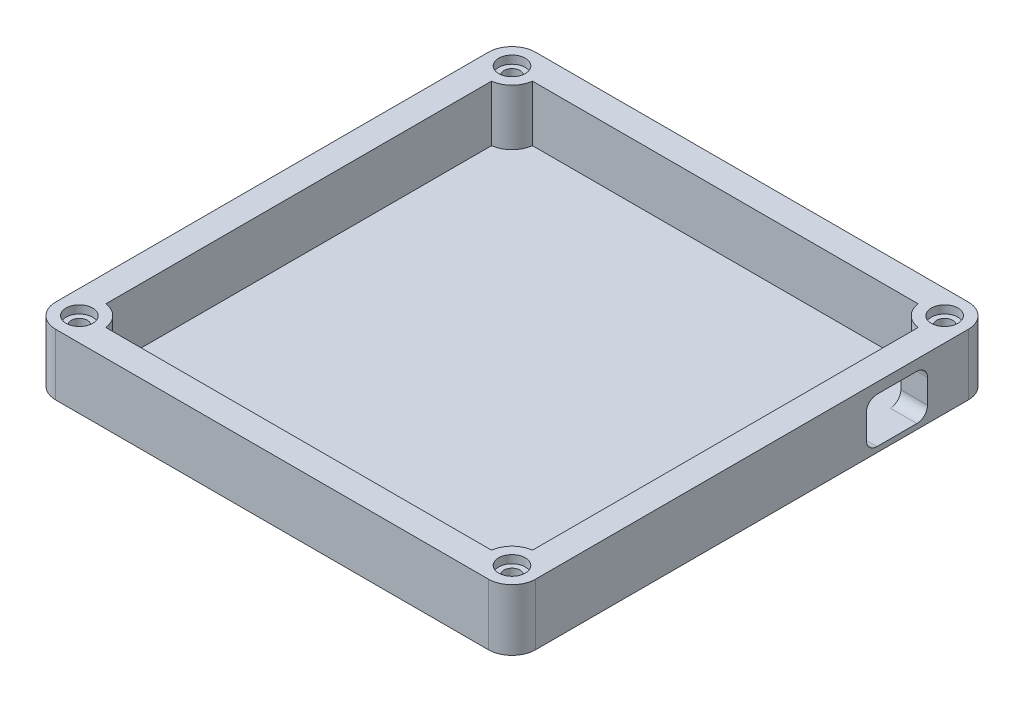
ISO-10303-21;
HEADER;
FILE_DESCRIPTION(('STEP AP214'),'2;1');
FILE_NAME('part.step','',(''),(''),'','','');
FILE_SCHEMA(('AUTOMOTIVE_DESIGN { 1 0 10303 214 1 1 1 1 }'));
ENDSEC;
DATA;
#1=APPLICATION_CONTEXT('core data for automotive mechanical design processes');
#2=APPLICATION_PROTOCOL_DEFINITION('international standard','automotive_design',2000,#1);
#3=PRODUCT_CONTEXT('',#1,'mechanical');
#4=PRODUCT('Part','Part','',(#3));
#5=PRODUCT_RELATED_PRODUCT_CATEGORY('part','',(#4));
#6=PRODUCT_DEFINITION_FORMATION('','',#4);
#7=PRODUCT_DEFINITION_CONTEXT('part definition',#1,'design');
#8=PRODUCT_DEFINITION('design','',#6,#7);
#9=PRODUCT_DEFINITION_SHAPE('','',#8);
#10=(LENGTH_UNIT() NAMED_UNIT(*) SI_UNIT(.MILLI.,.METRE.));
#11=(NAMED_UNIT(*) PLANE_ANGLE_UNIT() SI_UNIT($,.RADIAN.));
#12=(NAMED_UNIT(*) SI_UNIT($,.STERADIAN.) SOLID_ANGLE_UNIT());
#13=UNCERTAINTY_MEASURE_WITH_UNIT(LENGTH_MEASURE(1.E-05),#10,'distance_accuracy_value','');
#14=(GEOMETRIC_REPRESENTATION_CONTEXT(3) GLOBAL_UNCERTAINTY_ASSIGNED_CONTEXT((#13)) GLOBAL_UNIT_ASSIGNED_CONTEXT((#10,
#11,#12)) REPRESENTATION_CONTEXT('',''));
#15=CARTESIAN_POINT('',(0.,0.,0.));
#16=DIRECTION('',(0.,0.,1.));
#17=DIRECTION('',(1.,0.,0.));
#18=AXIS2_PLACEMENT_3D('',#15,#16,#17);
#19=CARTESIAN_POINT('',(45.0808846481362,11.5,0.));
#20=DIRECTION('',(1.,0.,0.));
#21=DIRECTION('',(0.,0.,-1.));
#22=AXIS2_PLACEMENT_3D('',#19,#20,#21);
#23=PLANE('',#22);
#24=DIRECTION('',(0.,0.,1.));
#25=VECTOR('',#24,1.);
#26=CARTESIAN_POINT('',(45.0808846481362,0.,0.));
#27=LINE('',#26,#25);
#28=CARTESIAN_POINT('',(45.0808846481362,0.,-40.64));
#29=VERTEX_POINT('',#28);
#30=CARTESIAN_POINT('',(45.0808846481362,0.,40.64));
#31=VERTEX_POINT('',#30);
#32=EDGE_CURVE('E407',#29,#31,#27,.T.);
#33=ORIENTED_EDGE('',*,*,#32,.F.);
#34=DIRECTION('',(0.,-1.,0.));
#35=VECTOR('',#34,1.);
#36=CARTESIAN_POINT('',(45.0808846481362,11.5,-40.64));
#37=LINE('',#36,#35);
#38=CARTESIAN_POINT('',(45.0808846481362,11.5,-40.64));
#39=VERTEX_POINT('',#38);
#40=EDGE_CURVE('E446',#39,#29,#37,.T.);
#41=ORIENTED_EDGE('',*,*,#40,.F.);
#42=DIRECTION('',(0.,0.,1.));
#43=VECTOR('',#42,1.);
#44=CARTESIAN_POINT('',(45.0808846481362,11.5,0.));
#45=LINE('',#44,#43);
#46=CARTESIAN_POINT('',(45.0808846481362,11.5,40.64));
#47=VERTEX_POINT('',#46);
#48=EDGE_CURVE('E378',#39,#47,#45,.T.);
#49=ORIENTED_EDGE('',*,*,#48,.T.);
#50=DIRECTION('',(0.,-1.,0.));
#51=VECTOR('',#50,1.);
#52=CARTESIAN_POINT('',(45.0808846481362,11.5,40.64));
#53=LINE('',#52,#51);
#54=EDGE_CURVE('E449',#47,#31,#53,.T.);
#55=ORIENTED_EDGE('',*,*,#54,.T.);
#56=EDGE_LOOP('',(#33,#41,#49,#55));
#57=FACE_BOUND('',#56,.T.);
#58=DIRECTION('',(0.,-1.,0.));
#59=VECTOR('',#58,1.);
#60=CARTESIAN_POINT('',(45.0808846481362,0.,-32.979));
#61=LINE('',#60,#59);
#62=CARTESIAN_POINT('',(45.0808846481362,7.5,-32.979));
#63=VERTEX_POINT('',#62);
#64=CARTESIAN_POINT('',(45.0808846481362,3.,-32.979));
#65=VERTEX_POINT('',#64);
#66=EDGE_CURVE('E283',#63,#65,#61,.T.);
#67=ORIENTED_EDGE('',*,*,#66,.T.);
#68=CARTESIAN_POINT('',(45.0808846481362,3.,-30.979));
#69=DIRECTION('',(1.,0.,0.));
#70=DIRECTION('',(0.,0.,-1.));
#71=AXIS2_PLACEMENT_3D('',#68,#69,#70);
#72=CIRCLE('',#71,2.);
#73=CARTESIAN_POINT('',(45.0808846481362,0.999999999999999,-30.979));
#74=VERTEX_POINT('',#73);
#75=EDGE_CURVE('E280',#65,#74,#72,.F.);
#76=ORIENTED_EDGE('',*,*,#75,.T.);
#77=DIRECTION('',(0.,0.,1.));
#78=VECTOR('',#77,1.);
#79=CARTESIAN_POINT('',(45.0808846481362,0.999999999999999,0.));
#80=LINE('',#79,#78);
#81=CARTESIAN_POINT('',(45.0808846481362,0.999999999999999,-23.479));
#82=VERTEX_POINT('',#81);
#83=EDGE_CURVE('E216',#74,#82,#80,.T.);
#84=ORIENTED_EDGE('',*,*,#83,.T.);
#85=CARTESIAN_POINT('',(45.0808846481362,3.,-23.479));
#86=DIRECTION('',(1.,0.,0.));
#87=DIRECTION('',(0.,0.,-1.));
#88=AXIS2_PLACEMENT_3D('',#85,#86,#87);
#89=CIRCLE('',#88,2.);
#90=CARTESIAN_POINT('',(45.0808846481362,3.,-21.479));
#91=VERTEX_POINT('',#90);
#92=EDGE_CURVE('E303',#82,#91,#89,.F.);
#93=ORIENTED_EDGE('',*,*,#92,.T.);
#94=DIRECTION('',(0.,1.,0.));
#95=VECTOR('',#94,1.);
#96=CARTESIAN_POINT('',(45.0808846481362,0.,-21.479));
#97=LINE('',#96,#95);
#98=CARTESIAN_POINT('',(45.0808846481362,7.5,-21.479));
#99=VERTEX_POINT('',#98);
#100=EDGE_CURVE('E299',#91,#99,#97,.T.);
#101=ORIENTED_EDGE('',*,*,#100,.T.);
#102=CARTESIAN_POINT('',(45.0808846481362,7.5,-23.479));
#103=DIRECTION('',(1.,0.,0.));
#104=DIRECTION('',(0.,0.,-1.));
#105=AXIS2_PLACEMENT_3D('',#102,#103,#104);
#106=CIRCLE('',#105,2.);
#107=CARTESIAN_POINT('',(45.0808846481362,9.5,-23.479));
#108=VERTEX_POINT('',#107);
#109=EDGE_CURVE('E295',#108,#99,#106,.T.);
#110=ORIENTED_EDGE('',*,*,#109,.F.);
#111=DIRECTION('',(0.,0.,-1.));
#112=VECTOR('',#111,1.);
#113=CARTESIAN_POINT('',(45.0808846481362,9.5,0.));
#114=LINE('',#113,#112);
#115=CARTESIAN_POINT('',(45.0808846481362,9.5,-30.979));
#116=VERTEX_POINT('',#115);
#117=EDGE_CURVE('E291',#108,#116,#114,.T.);
#118=ORIENTED_EDGE('',*,*,#117,.T.);
#119=CARTESIAN_POINT('',(45.0808846481362,7.5,-30.979));
#120=DIRECTION('',(1.,0.,0.));
#121=DIRECTION('',(0.,0.,-1.));
#122=AXIS2_PLACEMENT_3D('',#119,#120,#121);
#123=CIRCLE('',#122,2.);
#124=EDGE_CURVE('E287',#63,#116,#123,.T.);
#125=ORIENTED_EDGE('',*,*,#124,.F.);
#126=EDGE_LOOP('',(#67,#76,#84,#93,#101,#110,#118,#125));
#127=FACE_BOUND('',#126,.T.);
#128=ADVANCED_FACE('F43',(#57,#127),#23,.T.);
#129=CARTESIAN_POINT('',(40.0808846481362,11.5,0.));
#130=DIRECTION('',(-1.,0.,0.));
#131=DIRECTION('',(0.,0.,1.));
#132=AXIS2_PLACEMENT_3D('',#129,#130,#131);
#133=PLANE('',#132);
#134=DIRECTION('',(0.,0.,-1.));
#135=VECTOR('',#134,1.);
#136=CARTESIAN_POINT('',(40.0808846481362,1.,0.));
#137=LINE('',#136,#135);
#138=CARTESIAN_POINT('',(40.0808846481362,0.999999999999999,36.2344527602848));
#139=VERTEX_POINT('',#138);
#140=CARTESIAN_POINT('',(40.0808846481362,0.999999999999999,-23.479));
#141=VERTEX_POINT('',#140);
#142=EDGE_CURVE('E61',#139,#141,#137,.T.);
#143=ORIENTED_EDGE('',*,*,#142,.F.);
#144=DIRECTION('',(0.,-1.,0.));
#145=VECTOR('',#144,1.);
#146=CARTESIAN_POINT('',(40.0808846481362,11.5,36.2344527602848));
#147=LINE('',#146,#145);
#148=CARTESIAN_POINT('',(40.0808846481362,11.5,36.2344527602848));
#149=VERTEX_POINT('',#148);
#150=EDGE_CURVE('E399',#149,#139,#147,.T.);
#151=ORIENTED_EDGE('',*,*,#150,.F.);
#152=DIRECTION('',(0.,0.,-1.));
#153=VECTOR('',#152,1.);
#154=CARTESIAN_POINT('',(40.0808846481362,11.5,0.));
#155=LINE('',#154,#153);
#156=CARTESIAN_POINT('',(40.0808846481362,11.5,-36.2344527602848));
#157=VERTEX_POINT('',#156);
#158=EDGE_CURVE('E368',#149,#157,#155,.T.);
#159=ORIENTED_EDGE('',*,*,#158,.T.);
#160=DIRECTION('',(0.,-1.,0.));
#161=VECTOR('',#160,1.);
#162=CARTESIAN_POINT('',(40.0808846481362,11.5,-36.2344527602848));
#163=LINE('',#162,#161);
#164=CARTESIAN_POINT('',(40.0808846481362,0.999999999999999,-36.2344527602848));
#165=VERTEX_POINT('',#164);
#166=EDGE_CURVE('E232',#157,#165,#163,.T.);
#167=ORIENTED_EDGE('',*,*,#166,.T.);
#168=CARTESIAN_POINT('',(40.0808846481362,1.,-30.979));
#169=VERTEX_POINT('',#168);
#170=EDGE_CURVE('E214',#169,#165,#137,.T.);
#171=ORIENTED_EDGE('',*,*,#170,.F.);
#172=CARTESIAN_POINT('',(40.0808846481362,3.,-30.979));
#173=DIRECTION('',(-1.,0.,0.));
#174=DIRECTION('',(0.,0.,1.));
#175=AXIS2_PLACEMENT_3D('',#172,#173,#174);
#176=CIRCLE('',#175,2.);
#177=CARTESIAN_POINT('',(40.0808846481362,3.,-32.979));
#178=VERTEX_POINT('',#177);
#179=EDGE_CURVE('E11',#169,#178,#176,.F.);
#180=ORIENTED_EDGE('',*,*,#179,.T.);
#181=DIRECTION('',(0.,1.,0.));
#182=VECTOR('',#181,1.);
#183=CARTESIAN_POINT('',(40.0808846481362,11.5,-32.979));
#184=LINE('',#183,#182);
#185=CARTESIAN_POINT('',(40.0808846481362,7.5,-32.979));
#186=VERTEX_POINT('',#185);
#187=EDGE_CURVE('E455',#178,#186,#184,.T.);
#188=ORIENTED_EDGE('',*,*,#187,.T.);
#189=CARTESIAN_POINT('',(40.0808846481362,7.5,-30.979));
#190=DIRECTION('',(-1.,0.,0.));
#191=DIRECTION('',(0.,0.,1.));
#192=AXIS2_PLACEMENT_3D('',#189,#190,#191);
#193=CIRCLE('',#192,2.);
#194=CARTESIAN_POINT('',(40.0808846481362,9.5,-30.979));
#195=VERTEX_POINT('',#194);
#196=EDGE_CURVE('E484',#195,#186,#193,.T.);
#197=ORIENTED_EDGE('',*,*,#196,.F.);
#198=DIRECTION('',(0.,0.,1.));
#199=VECTOR('',#198,1.);
#200=CARTESIAN_POINT('',(40.0808846481362,9.5,0.));
#201=LINE('',#200,#199);
#202=CARTESIAN_POINT('',(40.0808846481362,9.5,-23.479));
#203=VERTEX_POINT('',#202);
#204=EDGE_CURVE('E488',#195,#203,#201,.T.);
#205=ORIENTED_EDGE('',*,*,#204,.T.);
#206=CARTESIAN_POINT('',(40.0808846481362,7.5,-23.479));
#207=DIRECTION('',(-1.,0.,0.));
#208=DIRECTION('',(0.,0.,1.));
#209=AXIS2_PLACEMENT_3D('',#206,#207,#208);
#210=CIRCLE('',#209,2.);
#211=CARTESIAN_POINT('',(40.0808846481362,7.5,-21.479));
#212=VERTEX_POINT('',#211);
#213=EDGE_CURVE('E492',#212,#203,#210,.T.);
#214=ORIENTED_EDGE('',*,*,#213,.F.);
#215=DIRECTION('',(0.,-1.,0.));
#216=VECTOR('',#215,1.);
#217=CARTESIAN_POINT('',(40.0808846481362,11.5,-21.479));
#218=LINE('',#217,#216);
#219=CARTESIAN_POINT('',(40.0808846481362,3.,-21.479));
#220=VERTEX_POINT('',#219);
#221=EDGE_CURVE('E495',#212,#220,#218,.T.);
#222=ORIENTED_EDGE('',*,*,#221,.T.);
#223=CARTESIAN_POINT('',(40.0808846481362,3.,-23.479));
#224=DIRECTION('',(-1.,0.,0.));
#225=DIRECTION('',(0.,0.,1.));
#226=AXIS2_PLACEMENT_3D('',#223,#224,#225);
#227=CIRCLE('',#226,2.);
#228=EDGE_CURVE('E53',#220,#141,#227,.F.);
#229=ORIENTED_EDGE('',*,*,#228,.T.);
#230=EDGE_LOOP('',(#143,#151,#159,#167,#171,#180,#188,#197,#205,#214,#222,#229));
#231=FACE_BOUND('',#230,.T.);
#232=ADVANCED_FACE('F229',(#231),#133,.T.);
#233=CARTESIAN_POINT('',(0.,11.5,45.0808846481362));
#234=DIRECTION('',(0.,0.,-1.));
#235=DIRECTION('',(-1.,0.,0.));
#236=AXIS2_PLACEMENT_3D('',#233,#234,#235);
#237=PLANE('',#236);
#238=DIRECTION('',(1.,0.,0.));
#239=VECTOR('',#238,1.);
#240=CARTESIAN_POINT('',(0.,0.,45.0808846481362));
#241=LINE('',#240,#239);
#242=CARTESIAN_POINT('',(-40.64,0.,45.0808846481362));
#243=VERTEX_POINT('',#242);
#244=CARTESIAN_POINT('',(40.64,0.,45.0808846481362));
#245=VERTEX_POINT('',#244);
#246=EDGE_CURVE('E343',#243,#245,#241,.T.);
#247=ORIENTED_EDGE('',*,*,#246,.T.);
#248=DIRECTION('',(0.,-1.,0.));
#249=VECTOR('',#248,1.);
#250=CARTESIAN_POINT('',(40.64,11.5,45.0808846481362));
#251=LINE('',#250,#249);
#252=CARTESIAN_POINT('',(40.64,11.5,45.0808846481362));
#253=VERTEX_POINT('',#252);
#254=EDGE_CURVE('E452',#253,#245,#251,.T.);
#255=ORIENTED_EDGE('',*,*,#254,.F.);
#256=DIRECTION('',(1.,0.,0.));
#257=VECTOR('',#256,1.);
#258=CARTESIAN_POINT('',(0.,11.5,45.0808846481362));
#259=LINE('',#258,#257);
#260=CARTESIAN_POINT('',(-40.64,11.5,45.0808846481362));
#261=VERTEX_POINT('',#260);
#262=EDGE_CURVE('E371',#261,#253,#259,.T.);
#263=ORIENTED_EDGE('',*,*,#262,.F.);
#264=DIRECTION('',(0.,-1.,0.));
#265=VECTOR('',#264,1.);
#266=CARTESIAN_POINT('',(-40.64,11.5,45.0808846481362));
#267=LINE('',#266,#265);
#268=EDGE_CURVE('E429',#261,#243,#267,.T.);
#269=ORIENTED_EDGE('',*,*,#268,.T.);
#270=EDGE_LOOP('',(#247,#255,#263,#269));
#271=FACE_BOUND('',#270,.T.);
#272=ADVANCED_FACE('F539',(#271),#237,.F.);
#273=CARTESIAN_POINT('',(40.64,11.5,40.64));
#274=DIRECTION('',(0.,-1.,0.));
#275=DIRECTION('',(0.,0.,-1.));
#276=AXIS2_PLACEMENT_3D('',#273,#274,#275);
#277=CYLINDRICAL_SURFACE('',#276,4.44088464813619);
#278=CARTESIAN_POINT('',(40.64,0.,40.64));
#279=DIRECTION('',(0.,1.,0.));
#280=DIRECTION('',(0.,0.,1.));
#281=AXIS2_PLACEMENT_3D('',#278,#279,#280);
#282=CIRCLE('',#281,4.44088464813619);
#283=EDGE_CURVE('E403',#31,#245,#282,.F.);
#284=ORIENTED_EDGE('',*,*,#283,.F.);
#285=ORIENTED_EDGE('',*,*,#54,.F.);
#286=CARTESIAN_POINT('',(40.64,11.5,40.64));
#287=DIRECTION('',(0.,1.,0.));
#288=DIRECTION('',(0.,0.,1.));
#289=AXIS2_PLACEMENT_3D('',#286,#287,#288);
#290=CIRCLE('',#289,4.44088464813619);
#291=EDGE_CURVE('E374',#47,#253,#290,.F.);
#292=ORIENTED_EDGE('',*,*,#291,.T.);
#293=ORIENTED_EDGE('',*,*,#254,.T.);
#294=EDGE_LOOP('',(#284,#285,#292,#293));
#295=FACE_BOUND('',#294,.T.);
#296=ADVANCED_FACE('F547',(#295),#277,.T.);
#297=CARTESIAN_POINT('',(40.64,11.5,-40.64));
#298=DIRECTION('',(0.,-1.,0.));
#299=DIRECTION('',(0.,0.,-1.));
#300=AXIS2_PLACEMENT_3D('',#297,#298,#299);
#301=CYLINDRICAL_SURFACE('',#300,4.44088464813619);
#302=CARTESIAN_POINT('',(40.64,0.,-40.64));
#303=DIRECTION('',(0.,1.,0.));
#304=DIRECTION('',(0.,0.,1.));
#305=AXIS2_PLACEMENT_3D('',#302,#303,#304);
#306=CIRCLE('',#305,4.44088464813619);
#307=CARTESIAN_POINT('',(40.64,0.,-45.0808846481362));
#308=VERTEX_POINT('',#307);
#309=EDGE_CURVE('E411',#29,#308,#306,.T.);
#310=ORIENTED_EDGE('',*,*,#309,.T.);
#311=DIRECTION('',(0.,-1.,0.));
#312=VECTOR('',#311,1.);
#313=CARTESIAN_POINT('',(40.64,11.5,-45.0808846481362));
#314=LINE('',#313,#312);
#315=CARTESIAN_POINT('',(40.64,11.5,-45.0808846481362));
#316=VERTEX_POINT('',#315);
#317=EDGE_CURVE('E443',#316,#308,#314,.T.);
#318=ORIENTED_EDGE('',*,*,#317,.F.);
#319=CARTESIAN_POINT('',(40.64,11.5,-40.64));
#320=DIRECTION('',(0.,1.,0.));
#321=DIRECTION('',(0.,0.,1.));
#322=AXIS2_PLACEMENT_3D('',#319,#320,#321);
#323=CIRCLE('',#322,4.44088464813619);
#324=EDGE_CURVE('E382',#39,#316,#323,.T.);
#325=ORIENTED_EDGE('',*,*,#324,.F.);
#326=ORIENTED_EDGE('',*,*,#40,.T.);
#327=EDGE_LOOP('',(#310,#318,#325,#326));
#328=FACE_BOUND('',#327,.T.);
#329=ADVANCED_FACE('F545',(#328),#301,.T.);
#330=CARTESIAN_POINT('',(0.,11.5,-45.0808846481362));
#331=DIRECTION('',(0.,0.,-1.));
#332=DIRECTION('',(-1.,0.,0.));
#333=AXIS2_PLACEMENT_3D('',#330,#331,#332);
#334=PLANE('',#333);
#335=DIRECTION('',(1.,0.,0.));
#336=VECTOR('',#335,1.);
#337=CARTESIAN_POINT('',(0.,0.,-45.0808846481362));
#338=LINE('',#337,#336);
#339=CARTESIAN_POINT('',(-40.64,0.,-45.0808846481362));
#340=VERTEX_POINT('',#339);
#341=EDGE_CURVE('E415',#340,#308,#338,.T.);
#342=ORIENTED_EDGE('',*,*,#341,.F.);
#343=DIRECTION('',(0.,-1.,0.));
#344=VECTOR('',#343,1.);
#345=CARTESIAN_POINT('',(-40.64,11.5,-45.0808846481362));
#346=LINE('',#345,#344);
#347=CARTESIAN_POINT('',(-40.64,11.5,-45.0808846481362));
#348=VERTEX_POINT('',#347);
#349=EDGE_CURVE('E440',#348,#340,#346,.T.);
#350=ORIENTED_EDGE('',*,*,#349,.F.);
#351=DIRECTION('',(1.,0.,0.));
#352=VECTOR('',#351,1.);
#353=CARTESIAN_POINT('',(0.,11.5,-45.0808846481362));
#354=LINE('',#353,#352);
#355=EDGE_CURVE('E385',#348,#316,#354,.T.);
#356=ORIENTED_EDGE('',*,*,#355,.T.);
#357=ORIENTED_EDGE('',*,*,#317,.T.);
#358=EDGE_LOOP('',(#342,#350,#356,#357));
#359=FACE_BOUND('',#358,.T.);
#360=ADVANCED_FACE('F629',(#359),#334,.T.);
#361=CARTESIAN_POINT('',(-40.64,11.5,-40.64));
#362=DIRECTION('',(0.,-1.,0.));
#363=DIRECTION('',(0.,0.,-1.));
#364=AXIS2_PLACEMENT_3D('',#361,#362,#363);
#365=CYLINDRICAL_SURFACE('',#364,4.44088464813619);
#366=CARTESIAN_POINT('',(-40.64,0.,-40.64));
#367=DIRECTION('',(0.,1.,0.));
#368=DIRECTION('',(0.,0.,1.));
#369=AXIS2_PLACEMENT_3D('',#366,#367,#368);
#370=CIRCLE('',#369,4.44088464813619);
#371=CARTESIAN_POINT('',(-45.0808846481362,0.,-40.64));
#372=VERTEX_POINT('',#371);
#373=EDGE_CURVE('E419',#340,#372,#370,.T.);
#374=ORIENTED_EDGE('',*,*,#373,.T.);
#375=DIRECTION('',(0.,-1.,0.));
#376=VECTOR('',#375,1.);
#377=CARTESIAN_POINT('',(-45.0808846481362,11.5,-40.64));
#378=LINE('',#377,#376);
#379=CARTESIAN_POINT('',(-45.0808846481362,11.5,-40.64));
#380=VERTEX_POINT('',#379);
#381=EDGE_CURVE('E437',#380,#372,#378,.T.);
#382=ORIENTED_EDGE('',*,*,#381,.F.);
#383=CARTESIAN_POINT('',(-40.64,11.5,-40.64));
#384=DIRECTION('',(0.,1.,0.));
#385=DIRECTION('',(0.,0.,1.));
#386=AXIS2_PLACEMENT_3D('',#383,#384,#385);
#387=CIRCLE('',#386,4.44088464813619);
#388=EDGE_CURVE('E389',#348,#380,#387,.T.);
#389=ORIENTED_EDGE('',*,*,#388,.F.);
#390=ORIENTED_EDGE('',*,*,#349,.T.);
#391=EDGE_LOOP('',(#374,#382,#389,#390));
#392=FACE_BOUND('',#391,.T.);
#393=ADVANCED_FACE('F634',(#392),#365,.T.);
#394=CARTESIAN_POINT('',(-45.0808846481362,11.5,0.));
#395=DIRECTION('',(-1.,0.,0.));
#396=DIRECTION('',(0.,0.,1.));
#397=AXIS2_PLACEMENT_3D('',#394,#395,#396);
#398=PLANE('',#397);
#399=DIRECTION('',(0.,0.,-1.));
#400=VECTOR('',#399,1.);
#401=CARTESIAN_POINT('',(-45.0808846481362,0.,0.));
#402=LINE('',#401,#400);
#403=CARTESIAN_POINT('',(-45.0808846481362,0.,40.64));
#404=VERTEX_POINT('',#403);
#405=EDGE_CURVE('E423',#404,#372,#402,.T.);
#406=ORIENTED_EDGE('',*,*,#405,.F.);
#407=DIRECTION('',(0.,-1.,0.));
#408=VECTOR('',#407,1.);
#409=CARTESIAN_POINT('',(-45.0808846481362,11.5,40.64));
#410=LINE('',#409,#408);
#411=CARTESIAN_POINT('',(-45.0808846481362,11.5,40.64));
#412=VERTEX_POINT('',#411);
#413=EDGE_CURVE('E433',#412,#404,#410,.T.);
#414=ORIENTED_EDGE('',*,*,#413,.F.);
#415=DIRECTION('',(0.,0.,-1.));
#416=VECTOR('',#415,1.);
#417=CARTESIAN_POINT('',(-45.0808846481362,11.5,0.));
#418=LINE('',#417,#416);
#419=EDGE_CURVE('E392',#412,#380,#418,.T.);
#420=ORIENTED_EDGE('',*,*,#419,.T.);
#421=ORIENTED_EDGE('',*,*,#381,.T.);
#422=EDGE_LOOP('',(#406,#414,#420,#421));
#423=FACE_BOUND('',#422,.T.);
#424=ADVANCED_FACE('F580',(#423),#398,.T.);
#425=CARTESIAN_POINT('',(40.64,11.5,40.64));
#426=DIRECTION('',(0.,-1.,0.));
#427=DIRECTION('',(0.,0.,-1.));
#428=AXIS2_PLACEMENT_3D('',#425,#426,#427);
#429=CYLINDRICAL_SURFACE('',#428,4.44088464813619);
#430=ORIENTED_EDGE('',*,*,#150,.T.);
#431=CARTESIAN_POINT('',(40.64,1.,40.64));
#432=DIRECTION('',(0.,1.,0.));
#433=DIRECTION('',(0.,0.,1.));
#434=AXIS2_PLACEMENT_3D('',#431,#432,#433);
#435=CIRCLE('',#434,4.44088464813619);
#436=CARTESIAN_POINT('',(36.2344527602848,0.999999999999999,40.0808846481362));
#437=VERTEX_POINT('',#436);
#438=EDGE_CURVE('E68',#437,#139,#435,.F.);
#439=ORIENTED_EDGE('',*,*,#438,.F.);
#440=DIRECTION('',(0.,-1.,0.));
#441=VECTOR('',#440,1.);
#442=CARTESIAN_POINT('',(36.2344527602848,11.5,40.0808846481362));
#443=LINE('',#442,#441);
#444=CARTESIAN_POINT('',(36.2344527602848,11.5,40.0808846481362));
#445=VERTEX_POINT('',#444);
#446=EDGE_CURVE('E434',#445,#437,#443,.T.);
#447=ORIENTED_EDGE('',*,*,#446,.F.);
#448=CARTESIAN_POINT('',(40.64,11.5,40.64));
#449=DIRECTION('',(0.,1.,0.));
#450=DIRECTION('',(0.,0.,1.));
#451=AXIS2_PLACEMENT_3D('',#448,#449,#450);
#452=CIRCLE('',#451,4.44088464813619);
#453=EDGE_CURVE('E344',#149,#445,#452,.T.);
#454=ORIENTED_EDGE('',*,*,#453,.F.);
#455=EDGE_LOOP('',(#430,#439,#447,#454));
#456=FACE_BOUND('',#455,.T.);
#457=ADVANCED_FACE('F45',(#456),#429,.T.);
#458=CARTESIAN_POINT('',(0.,11.5,40.0808846481362));
#459=DIRECTION('',(0.,0.,1.));
#460=DIRECTION('',(1.,0.,0.));
#461=AXIS2_PLACEMENT_3D('',#458,#459,#460);
#462=PLANE('',#461);
#463=ORIENTED_EDGE('',*,*,#446,.T.);
#464=DIRECTION('',(1.,0.,0.));
#465=VECTOR('',#464,1.);
#466=CARTESIAN_POINT('',(0.,1.,40.0808846481362));
#467=LINE('',#466,#465);
#468=CARTESIAN_POINT('',(-36.2344527602848,0.999999999999999,40.0808846481362));
#469=VERTEX_POINT('',#468);
#470=EDGE_CURVE('E238',#469,#437,#467,.T.);
#471=ORIENTED_EDGE('',*,*,#470,.F.);
#472=DIRECTION('',(0.,-1.,0.));
#473=VECTOR('',#472,1.);
#474=CARTESIAN_POINT('',(-36.2344527602848,11.5,40.0808846481362));
#475=LINE('',#474,#473);
#476=CARTESIAN_POINT('',(-36.2344527602848,11.5,40.0808846481362));
#477=VERTEX_POINT('',#476);
#478=EDGE_CURVE('E476',#477,#469,#475,.T.);
#479=ORIENTED_EDGE('',*,*,#478,.F.);
#480=DIRECTION('',(-1.,0.,0.));
#481=VECTOR('',#480,1.);
#482=CARTESIAN_POINT('',(0.,11.5,40.0808846481362));
#483=LINE('',#482,#481);
#484=EDGE_CURVE('E348',#445,#477,#483,.T.);
#485=ORIENTED_EDGE('',*,*,#484,.F.);
#486=EDGE_LOOP('',(#463,#471,#479,#485));
#487=FACE_BOUND('',#486,.T.);
#488=ADVANCED_FACE('F573',(#487),#462,.F.);
#489=CARTESIAN_POINT('',(-40.64,11.5,40.64));
#490=DIRECTION('',(0.,-1.,0.));
#491=DIRECTION('',(0.,0.,-1.));
#492=AXIS2_PLACEMENT_3D('',#489,#490,#491);
#493=CYLINDRICAL_SURFACE('',#492,4.44088464813619);
#494=ORIENTED_EDGE('',*,*,#478,.T.);
#495=CARTESIAN_POINT('',(-40.64,1.,40.64));
#496=DIRECTION('',(0.,1.,0.));
#497=DIRECTION('',(0.,0.,1.));
#498=AXIS2_PLACEMENT_3D('',#495,#496,#497);
#499=CIRCLE('',#498,4.44088464813619);
#500=CARTESIAN_POINT('',(-40.0808846481362,0.999999999999999,36.2344527602848));
#501=VERTEX_POINT('',#500);
#502=EDGE_CURVE('E271',#501,#469,#499,.F.);
#503=ORIENTED_EDGE('',*,*,#502,.F.);
#504=DIRECTION('',(0.,-1.,0.));
#505=VECTOR('',#504,1.);
#506=CARTESIAN_POINT('',(-40.0808846481362,11.5,36.2344527602848));
#507=LINE('',#506,#505);
#508=CARTESIAN_POINT('',(-40.0808846481362,11.5,36.2344527602848));
#509=VERTEX_POINT('',#508);
#510=EDGE_CURVE('E472',#509,#501,#507,.T.);
#511=ORIENTED_EDGE('',*,*,#510,.F.);
#512=CARTESIAN_POINT('',(-40.64,11.5,40.64));
#513=DIRECTION('',(0.,1.,0.));
#514=DIRECTION('',(0.,0.,1.));
#515=AXIS2_PLACEMENT_3D('',#512,#513,#514);
#516=CIRCLE('',#515,4.44088464813619);
#517=EDGE_CURVE('E352',#477,#509,#516,.T.);
#518=ORIENTED_EDGE('',*,*,#517,.F.);
#519=EDGE_LOOP('',(#494,#503,#511,#518));
#520=FACE_BOUND('',#519,.T.);
#521=ADVANCED_FACE('F570',(#520),#493,.T.);
#522=CARTESIAN_POINT('',(-40.0808846481362,11.5,0.));
#523=DIRECTION('',(-1.,0.,0.));
#524=DIRECTION('',(0.,0.,1.));
#525=AXIS2_PLACEMENT_3D('',#522,#523,#524);
#526=PLANE('',#525);
#527=ORIENTED_EDGE('',*,*,#510,.T.);
#528=DIRECTION('',(0.,0.,1.));
#529=VECTOR('',#528,1.);
#530=CARTESIAN_POINT('',(-40.0808846481362,1.,0.));
#531=LINE('',#530,#529);
#532=CARTESIAN_POINT('',(-40.0808846481362,0.999999999999999,-36.2344527602848));
#533=VERTEX_POINT('',#532);
#534=EDGE_CURVE('E586',#533,#501,#531,.T.);
#535=ORIENTED_EDGE('',*,*,#534,.F.);
#536=DIRECTION('',(0.,-1.,0.));
#537=VECTOR('',#536,1.);
#538=CARTESIAN_POINT('',(-40.0808846481362,11.5,-36.2344527602848));
#539=LINE('',#538,#537);
#540=CARTESIAN_POINT('',(-40.0808846481362,11.5,-36.2344527602848));
#541=VERTEX_POINT('',#540);
#542=EDGE_CURVE('E468',#541,#533,#539,.T.);
#543=ORIENTED_EDGE('',*,*,#542,.F.);
#544=DIRECTION('',(0.,0.,-1.));
#545=VECTOR('',#544,1.);
#546=CARTESIAN_POINT('',(-40.0808846481362,11.5,0.));
#547=LINE('',#546,#545);
#548=EDGE_CURVE('E355',#509,#541,#547,.T.);
#549=ORIENTED_EDGE('',*,*,#548,.F.);
#550=EDGE_LOOP('',(#527,#535,#543,#549));
#551=FACE_BOUND('',#550,.T.);
#552=ADVANCED_FACE('F566',(#551),#526,.F.);
#553=CARTESIAN_POINT('',(-40.64,11.5,-40.64));
#554=DIRECTION('',(0.,-1.,0.));
#555=DIRECTION('',(0.,0.,-1.));
#556=AXIS2_PLACEMENT_3D('',#553,#554,#555);
#557=CYLINDRICAL_SURFACE('',#556,4.44088464813619);
#558=ORIENTED_EDGE('',*,*,#542,.T.);
#559=CARTESIAN_POINT('',(-40.64,1.,-40.64));
#560=DIRECTION('',(0.,1.,0.));
#561=DIRECTION('',(0.,0.,1.));
#562=AXIS2_PLACEMENT_3D('',#559,#560,#561);
#563=CIRCLE('',#562,4.44088464813619);
#564=CARTESIAN_POINT('',(-36.2344527602848,0.999999999999999,-40.0808846481362));
#565=VERTEX_POINT('',#564);
#566=EDGE_CURVE('E591',#565,#533,#563,.F.);
#567=ORIENTED_EDGE('',*,*,#566,.F.);
#568=DIRECTION('',(0.,-1.,0.));
#569=VECTOR('',#568,1.);
#570=CARTESIAN_POINT('',(-36.2344527602848,11.5,-40.0808846481362));
#571=LINE('',#570,#569);
#572=CARTESIAN_POINT('',(-36.2344527602848,11.5,-40.0808846481362));
#573=VERTEX_POINT('',#572);
#574=EDGE_CURVE('E464',#573,#565,#571,.T.);
#575=ORIENTED_EDGE('',*,*,#574,.F.);
#576=CARTESIAN_POINT('',(-40.64,11.5,-40.64));
#577=DIRECTION('',(0.,1.,0.));
#578=DIRECTION('',(0.,0.,1.));
#579=AXIS2_PLACEMENT_3D('',#576,#577,#578);
#580=CIRCLE('',#579,4.44088464813619);
#581=EDGE_CURVE('E358',#541,#573,#580,.T.);
#582=ORIENTED_EDGE('',*,*,#581,.F.);
#583=EDGE_LOOP('',(#558,#567,#575,#582));
#584=FACE_BOUND('',#583,.T.);
#585=ADVANCED_FACE('F562',(#584),#557,.T.);
#586=CARTESIAN_POINT('',(0.,11.5,-40.0808846481362));
#587=DIRECTION('',(0.,0.,1.));
#588=DIRECTION('',(1.,0.,0.));
#589=AXIS2_PLACEMENT_3D('',#586,#587,#588);
#590=PLANE('',#589);
#591=DIRECTION('',(-1.,0.,0.));
#592=VECTOR('',#591,1.);
#593=CARTESIAN_POINT('',(0.,1.,-40.0808846481362));
#594=LINE('',#593,#592);
#595=CARTESIAN_POINT('',(36.2344527602848,0.999999999999999,-40.0808846481362));
#596=VERTEX_POINT('',#595);
#597=EDGE_CURVE('E595',#596,#565,#594,.T.);
#598=ORIENTED_EDGE('',*,*,#597,.F.);
#599=DIRECTION('',(0.,-1.,0.));
#600=VECTOR('',#599,1.);
#601=CARTESIAN_POINT('',(36.2344527602848,11.5,-40.0808846481362));
#602=LINE('',#601,#600);
#603=CARTESIAN_POINT('',(36.2344527602848,11.5,-40.0808846481362));
#604=VERTEX_POINT('',#603);
#605=EDGE_CURVE('E460',#604,#596,#602,.T.);
#606=ORIENTED_EDGE('',*,*,#605,.F.);
#607=DIRECTION('',(-1.,0.,0.));
#608=VECTOR('',#607,1.);
#609=CARTESIAN_POINT('',(0.,11.5,-40.0808846481362));
#610=LINE('',#609,#608);
#611=EDGE_CURVE('E361',#604,#573,#610,.T.);
#612=ORIENTED_EDGE('',*,*,#611,.T.);
#613=ORIENTED_EDGE('',*,*,#574,.T.);
#614=EDGE_LOOP('',(#598,#606,#612,#613));
#615=FACE_BOUND('',#614,.T.);
#616=ADVANCED_FACE('F558',(#615),#590,.T.);
#617=CARTESIAN_POINT('',(40.64,11.5,-40.64));
#618=DIRECTION('',(0.,-1.,0.));
#619=DIRECTION('',(0.,0.,-1.));
#620=AXIS2_PLACEMENT_3D('',#617,#618,#619);
#621=CYLINDRICAL_SURFACE('',#620,4.44088464813619);
#622=ORIENTED_EDGE('',*,*,#605,.T.);
#623=CARTESIAN_POINT('',(40.64,1.,-40.64));
#624=DIRECTION('',(0.,1.,0.));
#625=DIRECTION('',(0.,0.,1.));
#626=AXIS2_PLACEMENT_3D('',#623,#624,#625);
#627=CIRCLE('',#626,4.44088464813619);
#628=EDGE_CURVE('E237',#165,#596,#627,.F.);
#629=ORIENTED_EDGE('',*,*,#628,.F.);
#630=ORIENTED_EDGE('',*,*,#166,.F.);
#631=CARTESIAN_POINT('',(40.64,11.5,-40.64));
#632=DIRECTION('',(0.,1.,0.));
#633=DIRECTION('',(0.,0.,1.));
#634=AXIS2_PLACEMENT_3D('',#631,#632,#633);
#635=CIRCLE('',#634,4.44088464813619);
#636=EDGE_CURVE('E365',#604,#157,#635,.T.);
#637=ORIENTED_EDGE('',*,*,#636,.F.);
#638=EDGE_LOOP('',(#622,#629,#630,#637));
#639=FACE_BOUND('',#638,.T.);
#640=ADVANCED_FACE('F554',(#639),#621,.T.);
#641=CARTESIAN_POINT('',(-40.64,11.5,40.64));
#642=DIRECTION('',(0.,-1.,0.));
#643=DIRECTION('',(0.,0.,-1.));
#644=AXIS2_PLACEMENT_3D('',#641,#642,#643);
#645=CYLINDRICAL_SURFACE('',#644,4.44088464813619);
#646=CARTESIAN_POINT('',(-40.64,0.,40.64));
#647=DIRECTION('',(0.,1.,0.));
#648=DIRECTION('',(0.,0.,1.));
#649=AXIS2_PLACEMENT_3D('',#646,#647,#648);
#650=CIRCLE('',#649,4.44088464813619);
#651=EDGE_CURVE('E349',#404,#243,#650,.T.);
#652=ORIENTED_EDGE('',*,*,#651,.T.);
#653=ORIENTED_EDGE('',*,*,#268,.F.);
#654=CARTESIAN_POINT('',(-40.64,11.5,40.64));
#655=DIRECTION('',(0.,1.,0.));
#656=DIRECTION('',(0.,0.,1.));
#657=AXIS2_PLACEMENT_3D('',#654,#655,#656);
#658=CIRCLE('',#657,4.44088464813619);
#659=EDGE_CURVE('E396',#412,#261,#658,.T.);
#660=ORIENTED_EDGE('',*,*,#659,.F.);
#661=ORIENTED_EDGE('',*,*,#413,.T.);
#662=EDGE_LOOP('',(#652,#653,#660,#661));
#663=FACE_BOUND('',#662,.T.);
#664=ADVANCED_FACE('F557',(#663),#645,.T.);
#665=CARTESIAN_POINT('',(0.,11.5,0.));
#666=DIRECTION('',(0.,1.,0.));
#667=DIRECTION('',(0.,0.,1.));
#668=AXIS2_PLACEMENT_3D('',#665,#666,#667);
#669=PLANE('',#668);
#670=CARTESIAN_POINT('',(-40.64,11.5,40.64));
#671=DIRECTION('',(0.,1.,0.));
#672=DIRECTION('',(0.,0.,1.));
#673=AXIS2_PLACEMENT_3D('',#670,#671,#672);
#674=CIRCLE('',#673,2.5);
#675=CARTESIAN_POINT('',(-40.64,11.5,43.14));
#676=VERTEX_POINT('',#675);
#677=EDGE_CURVE('E267',#676,#676,#674,.T.);
#678=ORIENTED_EDGE('',*,*,#677,.F.);
#679=EDGE_LOOP('',(#678));
#680=FACE_BOUND('',#679,.T.);
#681=CARTESIAN_POINT('',(40.64,11.5,40.64));
#682=DIRECTION('',(0.,1.,0.));
#683=DIRECTION('',(0.,0.,1.));
#684=AXIS2_PLACEMENT_3D('',#681,#682,#683);
#685=CIRCLE('',#684,2.5);
#686=CARTESIAN_POINT('',(40.64,11.5,43.14));
#687=VERTEX_POINT('',#686);
#688=EDGE_CURVE('E259',#687,#687,#685,.T.);
#689=ORIENTED_EDGE('',*,*,#688,.F.);
#690=EDGE_LOOP('',(#689));
#691=FACE_BOUND('',#690,.T.);
#692=CARTESIAN_POINT('',(40.64,11.5,-40.64));
#693=DIRECTION('',(0.,1.,0.));
#694=DIRECTION('',(0.,0.,1.));
#695=AXIS2_PLACEMENT_3D('',#692,#693,#694);
#696=CIRCLE('',#695,2.5);
#697=CARTESIAN_POINT('',(40.64,11.5,-38.14));
#698=VERTEX_POINT('',#697);
#699=EDGE_CURVE('E251',#698,#698,#696,.T.);
#700=ORIENTED_EDGE('',*,*,#699,.F.);
#701=EDGE_LOOP('',(#700));
#702=FACE_BOUND('',#701,.T.);
#703=CARTESIAN_POINT('',(-40.64,11.5,-40.64));
#704=DIRECTION('',(0.,1.,0.));
#705=DIRECTION('',(0.,0.,1.));
#706=AXIS2_PLACEMENT_3D('',#703,#704,#705);
#707=CIRCLE('',#706,2.5);
#708=CARTESIAN_POINT('',(-40.64,11.5,-38.14));
#709=VERTEX_POINT('',#708);
#710=EDGE_CURVE('E250',#709,#709,#707,.T.);
#711=ORIENTED_EDGE('',*,*,#710,.F.);
#712=EDGE_LOOP('',(#711));
#713=FACE_BOUND('',#712,.T.);
#714=ORIENTED_EDGE('',*,*,#453,.T.);
#715=ORIENTED_EDGE('',*,*,#484,.T.);
#716=ORIENTED_EDGE('',*,*,#517,.T.);
#717=ORIENTED_EDGE('',*,*,#548,.T.);
#718=ORIENTED_EDGE('',*,*,#581,.T.);
#719=ORIENTED_EDGE('',*,*,#611,.F.);
#720=ORIENTED_EDGE('',*,*,#636,.T.);
#721=ORIENTED_EDGE('',*,*,#158,.F.);
#722=EDGE_LOOP('',(#714,#715,#716,#717,#718,#719,#720,#721));
#723=FACE_BOUND('',#722,.T.);
#724=ORIENTED_EDGE('',*,*,#262,.T.);
#725=ORIENTED_EDGE('',*,*,#291,.F.);
#726=ORIENTED_EDGE('',*,*,#48,.F.);
#727=ORIENTED_EDGE('',*,*,#324,.T.);
#728=ORIENTED_EDGE('',*,*,#355,.F.);
#729=ORIENTED_EDGE('',*,*,#388,.T.);
#730=ORIENTED_EDGE('',*,*,#419,.F.);
#731=ORIENTED_EDGE('',*,*,#659,.T.);
#732=EDGE_LOOP('',(#724,#725,#726,#727,#728,#729,#730,#731));
#733=FACE_BOUND('',#732,.T.);
#734=ADVANCED_FACE('F607',(#680,#691,#702,#713,#723,#733),#669,.T.);
#735=CARTESIAN_POINT('',(0.,0.,0.));
#736=DIRECTION('',(0.,1.,0.));
#737=DIRECTION('',(0.,0.,1.));
#738=AXIS2_PLACEMENT_3D('',#735,#736,#737);
#739=PLANE('',#738);
#740=ORIENTED_EDGE('',*,*,#246,.F.);
#741=ORIENTED_EDGE('',*,*,#651,.F.);
#742=ORIENTED_EDGE('',*,*,#405,.T.);
#743=ORIENTED_EDGE('',*,*,#373,.F.);
#744=ORIENTED_EDGE('',*,*,#341,.T.);
#745=ORIENTED_EDGE('',*,*,#309,.F.);
#746=ORIENTED_EDGE('',*,*,#32,.T.);
#747=ORIENTED_EDGE('',*,*,#283,.T.);
#748=EDGE_LOOP('',(#740,#741,#742,#743,#744,#745,#746,#747));
#749=FACE_BOUND('',#748,.T.);
#750=ADVANCED_FACE('F611',(#749),#739,.F.);
#751=CARTESIAN_POINT('',(37.0808846481362,3.,-30.979));
#752=DIRECTION('',(1.,0.,0.));
#753=DIRECTION('',(0.,0.,-1.));
#754=AXIS2_PLACEMENT_3D('',#751,#752,#753);
#755=CYLINDRICAL_SURFACE('',#754,2.);
#756=DIRECTION('',(1.,0.,0.));
#757=VECTOR('',#756,1.);
#758=CARTESIAN_POINT('',(37.0808846481362,0.999999999999999,-30.979));
#759=LINE('',#758,#757);
#760=EDGE_CURVE('E209',#169,#74,#759,.T.);
#761=ORIENTED_EDGE('',*,*,#760,.T.);
#762=ORIENTED_EDGE('',*,*,#75,.F.);
#763=DIRECTION('',(1.,0.,0.));
#764=VECTOR('',#763,1.);
#765=CARTESIAN_POINT('',(37.0808846481362,3.,-32.979));
#766=LINE('',#765,#764);
#767=EDGE_CURVE('E226',#178,#65,#766,.T.);
#768=ORIENTED_EDGE('',*,*,#767,.F.);
#769=ORIENTED_EDGE('',*,*,#179,.F.);
#770=EDGE_LOOP('',(#761,#762,#768,#769));
#771=FACE_BOUND('',#770,.T.);
#772=ADVANCED_FACE('F224',(#771),#755,.F.);
#773=CARTESIAN_POINT('',(37.0808846481362,0.999999999999999,0.));
#774=DIRECTION('',(0.,1.,0.));
#775=DIRECTION('',(0.,0.,1.));
#776=AXIS2_PLACEMENT_3D('',#773,#774,#775);
#777=PLANE('',#776);
#778=DIRECTION('',(1.,0.,0.));
#779=VECTOR('',#778,1.);
#780=CARTESIAN_POINT('',(37.0808846481362,0.999999999999999,-23.479));
#781=LINE('',#780,#779);
#782=EDGE_CURVE('E221',#141,#82,#781,.T.);
#783=ORIENTED_EDGE('',*,*,#782,.T.);
#784=ORIENTED_EDGE('',*,*,#83,.F.);
#785=ORIENTED_EDGE('',*,*,#760,.F.);
#786=ORIENTED_EDGE('',*,*,#170,.T.);
#787=ORIENTED_EDGE('',*,*,#628,.T.);
#788=ORIENTED_EDGE('',*,*,#597,.T.);
#789=ORIENTED_EDGE('',*,*,#566,.T.);
#790=ORIENTED_EDGE('',*,*,#534,.T.);
#791=ORIENTED_EDGE('',*,*,#502,.T.);
#792=ORIENTED_EDGE('',*,*,#470,.T.);
#793=ORIENTED_EDGE('',*,*,#438,.T.);
#794=ORIENTED_EDGE('',*,*,#142,.T.);
#795=EDGE_LOOP('',(#783,#784,#785,#786,#787,#788,#789,#790,#791,#792,#793,#794));
#796=FACE_BOUND('',#795,.T.);
#797=ADVANCED_FACE('F211',(#796),#777,.T.);
#798=CARTESIAN_POINT('',(37.0808846481362,3.,-23.479));
#799=DIRECTION('',(1.,0.,0.));
#800=DIRECTION('',(0.,0.,-1.));
#801=AXIS2_PLACEMENT_3D('',#798,#799,#800);
#802=CYLINDRICAL_SURFACE('',#801,2.);
#803=DIRECTION('',(1.,0.,0.));
#804=VECTOR('',#803,1.);
#805=CARTESIAN_POINT('',(37.0808846481362,3.,-21.479));
#806=LINE('',#805,#804);
#807=EDGE_CURVE('E311',#220,#91,#806,.T.);
#808=ORIENTED_EDGE('',*,*,#807,.T.);
#809=ORIENTED_EDGE('',*,*,#92,.F.);
#810=ORIENTED_EDGE('',*,*,#782,.F.);
#811=ORIENTED_EDGE('',*,*,#228,.F.);
#812=EDGE_LOOP('',(#808,#809,#810,#811));
#813=FACE_BOUND('',#812,.T.);
#814=ADVANCED_FACE('F742',(#813),#802,.F.);
#815=CARTESIAN_POINT('',(37.0808846481362,0.,-21.479));
#816=DIRECTION('',(0.,0.,-1.));
#817=DIRECTION('',(-1.,0.,0.));
#818=AXIS2_PLACEMENT_3D('',#815,#816,#817);
#819=PLANE('',#818);
#820=DIRECTION('',(1.,0.,0.));
#821=VECTOR('',#820,1.);
#822=CARTESIAN_POINT('',(37.0808846481362,7.5,-21.479));
#823=LINE('',#822,#821);
#824=EDGE_CURVE('E314',#212,#99,#823,.T.);
#825=ORIENTED_EDGE('',*,*,#824,.T.);
#826=ORIENTED_EDGE('',*,*,#100,.F.);
#827=ORIENTED_EDGE('',*,*,#807,.F.);
#828=ORIENTED_EDGE('',*,*,#221,.F.);
#829=EDGE_LOOP('',(#825,#826,#827,#828));
#830=FACE_BOUND('',#829,.T.);
#831=ADVANCED_FACE('F747',(#830),#819,.T.);
#832=CARTESIAN_POINT('',(37.0808846481362,7.5,-23.479));
#833=DIRECTION('',(1.,0.,0.));
#834=DIRECTION('',(0.,0.,-1.));
#835=AXIS2_PLACEMENT_3D('',#832,#833,#834);
#836=CYLINDRICAL_SURFACE('',#835,2.);
#837=ORIENTED_EDGE('',*,*,#213,.T.);
#838=DIRECTION('',(1.,0.,0.));
#839=VECTOR('',#838,1.);
#840=CARTESIAN_POINT('',(37.0808846481362,9.5,-23.479));
#841=LINE('',#840,#839);
#842=EDGE_CURVE('E317',#203,#108,#841,.T.);
#843=ORIENTED_EDGE('',*,*,#842,.T.);
#844=ORIENTED_EDGE('',*,*,#109,.T.);
#845=ORIENTED_EDGE('',*,*,#824,.F.);
#846=EDGE_LOOP('',(#837,#843,#844,#845));
#847=FACE_BOUND('',#846,.T.);
#848=ADVANCED_FACE('F758',(#847),#836,.F.);
#849=CARTESIAN_POINT('',(37.0808846481362,9.5,0.));
#850=DIRECTION('',(0.,-1.,0.));
#851=DIRECTION('',(0.,0.,-1.));
#852=AXIS2_PLACEMENT_3D('',#849,#850,#851);
#853=PLANE('',#852);
#854=DIRECTION('',(1.,0.,0.));
#855=VECTOR('',#854,1.);
#856=CARTESIAN_POINT('',(37.0808846481362,9.5,-30.979));
#857=LINE('',#856,#855);
#858=EDGE_CURVE('E320',#195,#116,#857,.T.);
#859=ORIENTED_EDGE('',*,*,#858,.T.);
#860=ORIENTED_EDGE('',*,*,#117,.F.);
#861=ORIENTED_EDGE('',*,*,#842,.F.);
#862=ORIENTED_EDGE('',*,*,#204,.F.);
#863=EDGE_LOOP('',(#859,#860,#861,#862));
#864=FACE_BOUND('',#863,.T.);
#865=ADVANCED_FACE('F765',(#864),#853,.T.);
#866=CARTESIAN_POINT('',(37.0808846481362,7.5,-30.979));
#867=DIRECTION('',(1.,0.,0.));
#868=DIRECTION('',(0.,0.,-1.));
#869=AXIS2_PLACEMENT_3D('',#866,#867,#868);
#870=CYLINDRICAL_SURFACE('',#869,2.);
#871=ORIENTED_EDGE('',*,*,#196,.T.);
#872=DIRECTION('',(1.,0.,0.));
#873=VECTOR('',#872,1.);
#874=CARTESIAN_POINT('',(37.0808846481362,7.5,-32.979));
#875=LINE('',#874,#873);
#876=EDGE_CURVE('E323',#186,#63,#875,.T.);
#877=ORIENTED_EDGE('',*,*,#876,.T.);
#878=ORIENTED_EDGE('',*,*,#124,.T.);
#879=ORIENTED_EDGE('',*,*,#858,.F.);
#880=EDGE_LOOP('',(#871,#877,#878,#879));
#881=FACE_BOUND('',#880,.T.);
#882=ADVANCED_FACE('F773',(#881),#870,.F.);
#883=CARTESIAN_POINT('',(37.0808846481362,0.,-32.979));
#884=DIRECTION('',(0.,0.,1.));
#885=DIRECTION('',(1.,0.,0.));
#886=AXIS2_PLACEMENT_3D('',#883,#884,#885);
#887=PLANE('',#886);
#888=ORIENTED_EDGE('',*,*,#767,.T.);
#889=ORIENTED_EDGE('',*,*,#66,.F.);
#890=ORIENTED_EDGE('',*,*,#876,.F.);
#891=ORIENTED_EDGE('',*,*,#187,.F.);
#892=EDGE_LOOP('',(#888,#889,#890,#891));
#893=FACE_BOUND('',#892,.T.);
#894=ADVANCED_FACE('F781',(#893),#887,.T.);
#895=CARTESIAN_POINT('',(-40.64,10.,40.64));
#896=DIRECTION('',(0.,1.,0.));
#897=DIRECTION('',(0.,0.,1.));
#898=AXIS2_PLACEMENT_3D('',#895,#896,#897);
#899=PLANE('',#898);
#900=CARTESIAN_POINT('',(-40.64,10.,40.64));
#901=DIRECTION('',(0.,1.,0.));
#902=DIRECTION('',(0.,0.,1.));
#903=AXIS2_PLACEMENT_3D('',#900,#901,#902);
#904=CIRCLE('',#903,2.5);
#905=CARTESIAN_POINT('',(-40.64,10.,43.14));
#906=VERTEX_POINT('',#905);
#907=EDGE_CURVE('E263',#906,#906,#904,.T.);
#908=ORIENTED_EDGE('',*,*,#907,.T.);
#909=EDGE_LOOP('',(#908));
#910=FACE_BOUND('',#909,.T.);
#911=CARTESIAN_POINT('',(-40.64,10.,40.64));
#912=DIRECTION('',(0.,1.,0.));
#913=DIRECTION('',(0.,0.,1.));
#914=AXIS2_PLACEMENT_3D('',#911,#912,#913);
#915=CIRCLE('',#914,1.5);
#916=CARTESIAN_POINT('',(-40.64,10.,42.14));
#917=VERTEX_POINT('',#916);
#918=EDGE_CURVE('E276',#917,#917,#915,.F.);
#919=ORIENTED_EDGE('',*,*,#918,.T.);
#920=EDGE_LOOP('',(#919));
#921=FACE_BOUND('',#920,.T.);
#922=ADVANCED_FACE('F788',(#910,#921),#899,.T.);
#923=CARTESIAN_POINT('',(-40.64,10.,40.64));
#924=DIRECTION('',(0.,1.,0.));
#925=DIRECTION('',(0.,0.,1.));
#926=AXIS2_PLACEMENT_3D('',#923,#924,#925);
#927=CYLINDRICAL_SURFACE('',#926,2.5);
#928=ORIENTED_EDGE('',*,*,#907,.F.);
#929=EDGE_LOOP('',(#928));
#930=FACE_BOUND('',#929,.T.);
#931=ORIENTED_EDGE('',*,*,#677,.T.);
#932=EDGE_LOOP('',(#931));
#933=FACE_BOUND('',#932,.T.);
#934=ADVANCED_FACE('F795',(#930,#933),#927,.F.);
#935=CARTESIAN_POINT('',(40.64,10.,40.64));
#936=DIRECTION('',(0.,1.,0.));
#937=DIRECTION('',(0.,0.,1.));
#938=AXIS2_PLACEMENT_3D('',#935,#936,#937);
#939=PLANE('',#938);
#940=CARTESIAN_POINT('',(40.64,10.,40.64));
#941=DIRECTION('',(0.,1.,0.));
#942=DIRECTION('',(0.,0.,1.));
#943=AXIS2_PLACEMENT_3D('',#940,#941,#942);
#944=CIRCLE('',#943,2.5);
#945=CARTESIAN_POINT('',(40.64,10.,43.14));
#946=VERTEX_POINT('',#945);
#947=EDGE_CURVE('E255',#946,#946,#944,.T.);
#948=ORIENTED_EDGE('',*,*,#947,.T.);
#949=EDGE_LOOP('',(#948));
#950=FACE_BOUND('',#949,.T.);
#951=CARTESIAN_POINT('',(40.64,10.,40.64));
#952=DIRECTION('',(0.,1.,0.));
#953=DIRECTION('',(0.,0.,1.));
#954=AXIS2_PLACEMENT_3D('',#951,#952,#953);
#955=CIRCLE('',#954,1.5);
#956=CARTESIAN_POINT('',(40.64,10.,42.14));
#957=VERTEX_POINT('',#956);
#958=EDGE_CURVE('E504',#957,#957,#955,.F.);
#959=ORIENTED_EDGE('',*,*,#958,.T.);
#960=EDGE_LOOP('',(#959));
#961=FACE_BOUND('',#960,.T.);
#962=ADVANCED_FACE('F803',(#950,#961),#939,.T.);
#963=CARTESIAN_POINT('',(40.64,10.,40.64));
#964=DIRECTION('',(0.,1.,0.));
#965=DIRECTION('',(0.,0.,1.));
#966=AXIS2_PLACEMENT_3D('',#963,#964,#965);
#967=CYLINDRICAL_SURFACE('',#966,2.5);
#968=ORIENTED_EDGE('',*,*,#947,.F.);
#969=EDGE_LOOP('',(#968));
#970=FACE_BOUND('',#969,.T.);
#971=ORIENTED_EDGE('',*,*,#688,.T.);
#972=EDGE_LOOP('',(#971));
#973=FACE_BOUND('',#972,.T.);
#974=ADVANCED_FACE('F811',(#970,#973),#967,.F.);
#975=CARTESIAN_POINT('',(40.64,10.,-40.64));
#976=DIRECTION('',(0.,1.,0.));
#977=DIRECTION('',(0.,0.,1.));
#978=AXIS2_PLACEMENT_3D('',#975,#976,#977);
#979=PLANE('',#978);
#980=CARTESIAN_POINT('',(40.64,10.,-40.64));
#981=DIRECTION('',(0.,1.,0.));
#982=DIRECTION('',(0.,0.,1.));
#983=AXIS2_PLACEMENT_3D('',#980,#981,#982);
#984=CIRCLE('',#983,2.5);
#985=CARTESIAN_POINT('',(40.64,10.,-38.14));
#986=VERTEX_POINT('',#985);
#987=EDGE_CURVE('E246',#986,#986,#984,.T.);
#988=ORIENTED_EDGE('',*,*,#987,.T.);
#989=EDGE_LOOP('',(#988));
#990=FACE_BOUND('',#989,.T.);
#991=CARTESIAN_POINT('',(40.64,10.,-40.64));
#992=DIRECTION('',(0.,1.,0.));
#993=DIRECTION('',(0.,0.,1.));
#994=AXIS2_PLACEMENT_3D('',#991,#992,#993);
#995=CIRCLE('',#994,1.5);
#996=CARTESIAN_POINT('',(40.64,10.,-39.14));
#997=VERTEX_POINT('',#996);
#998=EDGE_CURVE('E507',#997,#997,#995,.F.);
#999=ORIENTED_EDGE('',*,*,#998,.T.);
#1000=EDGE_LOOP('',(#999));
#1001=FACE_BOUND('',#1000,.T.);
#1002=ADVANCED_FACE('F819',(#990,#1001),#979,.T.);
#1003=CARTESIAN_POINT('',(40.64,10.,-40.64));
#1004=DIRECTION('',(0.,1.,0.));
#1005=DIRECTION('',(0.,0.,1.));
#1006=AXIS2_PLACEMENT_3D('',#1003,#1004,#1005);
#1007=CYLINDRICAL_SURFACE('',#1006,2.5);
#1008=ORIENTED_EDGE('',*,*,#987,.F.);
#1009=EDGE_LOOP('',(#1008));
#1010=FACE_BOUND('',#1009,.T.);
#1011=ORIENTED_EDGE('',*,*,#699,.T.);
#1012=EDGE_LOOP('',(#1011));
#1013=FACE_BOUND('',#1012,.T.);
#1014=ADVANCED_FACE('F827',(#1010,#1013),#1007,.F.);
#1015=CARTESIAN_POINT('',(-40.64,10.,-40.64));
#1016=DIRECTION('',(0.,1.,0.));
#1017=DIRECTION('',(0.,0.,1.));
#1018=AXIS2_PLACEMENT_3D('',#1015,#1016,#1017);
#1019=PLANE('',#1018);
#1020=CARTESIAN_POINT('',(-40.64,10.,-40.64));
#1021=DIRECTION('',(0.,1.,0.));
#1022=DIRECTION('',(0.,0.,1.));
#1023=AXIS2_PLACEMENT_3D('',#1020,#1021,#1022);
#1024=CIRCLE('',#1023,2.5);
#1025=CARTESIAN_POINT('',(-40.64,10.,-38.14));
#1026=VERTEX_POINT('',#1025);
#1027=EDGE_CURVE('E272',#1026,#1026,#1024,.T.);
#1028=ORIENTED_EDGE('',*,*,#1027,.T.);
#1029=EDGE_LOOP('',(#1028));
#1030=FACE_BOUND('',#1029,.T.);
#1031=CARTESIAN_POINT('',(-40.64,10.,-40.64));
#1032=DIRECTION('',(0.,1.,0.));
#1033=DIRECTION('',(0.,0.,1.));
#1034=AXIS2_PLACEMENT_3D('',#1031,#1032,#1033);
#1035=CIRCLE('',#1034,1.5);
#1036=CARTESIAN_POINT('',(-40.64,10.,-39.14));
#1037=VERTEX_POINT('',#1036);
#1038=EDGE_CURVE('E47',#1037,#1037,#1035,.F.);
#1039=ORIENTED_EDGE('',*,*,#1038,.T.);
#1040=EDGE_LOOP('',(#1039));
#1041=FACE_BOUND('',#1040,.T.);
#1042=ADVANCED_FACE('F516',(#1030,#1041),#1019,.T.);
#1043=CARTESIAN_POINT('',(-40.64,10.,-40.64));
#1044=DIRECTION('',(0.,1.,0.));
#1045=DIRECTION('',(0.,0.,1.));
#1046=AXIS2_PLACEMENT_3D('',#1043,#1044,#1045);
#1047=CYLINDRICAL_SURFACE('',#1046,2.5);
#1048=ORIENTED_EDGE('',*,*,#1027,.F.);
#1049=EDGE_LOOP('',(#1048));
#1050=FACE_BOUND('',#1049,.T.);
#1051=ORIENTED_EDGE('',*,*,#710,.T.);
#1052=EDGE_LOOP('',(#1051));
#1053=FACE_BOUND('',#1052,.T.);
#1054=ADVANCED_FACE('F842',(#1050,#1053),#1047,.F.);
#1055=CARTESIAN_POINT('',(-40.64,3.5,40.64));
#1056=DIRECTION('',(0.,1.,0.));
#1057=DIRECTION('',(0.,0.,1.));
#1058=AXIS2_PLACEMENT_3D('',#1055,#1056,#1057);
#1059=PLANE('',#1058);
#1060=CARTESIAN_POINT('',(-40.64,3.5,40.64));
#1061=DIRECTION('',(0.,1.,0.));
#1062=DIRECTION('',(0.,0.,1.));
#1063=AXIS2_PLACEMENT_3D('',#1060,#1061,#1062);
#1064=CIRCLE('',#1063,1.5);
#1065=CARTESIAN_POINT('',(-40.64,3.5,42.14));
#1066=VERTEX_POINT('',#1065);
#1067=EDGE_CURVE('E220',#1066,#1066,#1064,.T.);
#1068=ORIENTED_EDGE('',*,*,#1067,.T.);
#1069=EDGE_LOOP('',(#1068));
#1070=FACE_BOUND('',#1069,.T.);
#1071=ADVANCED_FACE('F850',(#1070),#1059,.T.);
#1072=CARTESIAN_POINT('',(-40.64,3.5,40.64));
#1073=DIRECTION('',(0.,1.,0.));
#1074=DIRECTION('',(0.,0.,1.));
#1075=AXIS2_PLACEMENT_3D('',#1072,#1073,#1074);
#1076=CYLINDRICAL_SURFACE('',#1075,1.5);
#1077=ORIENTED_EDGE('',*,*,#1067,.F.);
#1078=EDGE_LOOP('',(#1077));
#1079=FACE_BOUND('',#1078,.T.);
#1080=ORIENTED_EDGE('',*,*,#918,.F.);
#1081=EDGE_LOOP('',(#1080));
#1082=FACE_BOUND('',#1081,.T.);
#1083=ADVANCED_FACE('F859',(#1079,#1082),#1076,.F.);
#1084=CARTESIAN_POINT('',(40.64,3.5,40.64));
#1085=DIRECTION('',(0.,1.,0.));
#1086=DIRECTION('',(0.,0.,1.));
#1087=AXIS2_PLACEMENT_3D('',#1084,#1085,#1086);
#1088=PLANE('',#1087);
#1089=CARTESIAN_POINT('',(40.64,3.5,40.64));
#1090=DIRECTION('',(0.,1.,0.));
#1091=DIRECTION('',(0.,0.,1.));
#1092=AXIS2_PLACEMENT_3D('',#1089,#1090,#1091);
#1093=CIRCLE('',#1092,1.5);
#1094=CARTESIAN_POINT('',(40.64,3.5,42.14));
#1095=VERTEX_POINT('',#1094);
#1096=EDGE_CURVE('E333',#1095,#1095,#1093,.T.);
#1097=ORIENTED_EDGE('',*,*,#1096,.T.);
#1098=EDGE_LOOP('',(#1097));
#1099=FACE_BOUND('',#1098,.T.);
#1100=ADVANCED_FACE('F867',(#1099),#1088,.T.);
#1101=CARTESIAN_POINT('',(40.64,3.5,40.64));
#1102=DIRECTION('',(0.,1.,0.));
#1103=DIRECTION('',(0.,0.,1.));
#1104=AXIS2_PLACEMENT_3D('',#1101,#1102,#1103);
#1105=CYLINDRICAL_SURFACE('',#1104,1.5);
#1106=ORIENTED_EDGE('',*,*,#1096,.F.);
#1107=EDGE_LOOP('',(#1106));
#1108=FACE_BOUND('',#1107,.T.);
#1109=ORIENTED_EDGE('',*,*,#958,.F.);
#1110=EDGE_LOOP('',(#1109));
#1111=FACE_BOUND('',#1110,.T.);
#1112=ADVANCED_FACE('F875',(#1108,#1111),#1105,.F.);
#1113=CARTESIAN_POINT('',(40.64,3.5,-40.64));
#1114=DIRECTION('',(0.,1.,0.));
#1115=DIRECTION('',(0.,0.,1.));
#1116=AXIS2_PLACEMENT_3D('',#1113,#1114,#1115);
#1117=PLANE('',#1116);
#1118=CARTESIAN_POINT('',(40.64,3.5,-40.64));
#1119=DIRECTION('',(0.,1.,0.));
#1120=DIRECTION('',(0.,0.,1.));
#1121=AXIS2_PLACEMENT_3D('',#1118,#1119,#1120);
#1122=CIRCLE('',#1121,1.5);
#1123=CARTESIAN_POINT('',(40.64,3.5,-39.14));
#1124=VERTEX_POINT('',#1123);
#1125=EDGE_CURVE('E328',#1124,#1124,#1122,.T.);
#1126=ORIENTED_EDGE('',*,*,#1125,.T.);
#1127=EDGE_LOOP('',(#1126));
#1128=FACE_BOUND('',#1127,.T.);
#1129=ADVANCED_FACE('F883',(#1128),#1117,.T.);
#1130=CARTESIAN_POINT('',(40.64,3.5,-40.64));
#1131=DIRECTION('',(0.,1.,0.));
#1132=DIRECTION('',(0.,0.,1.));
#1133=AXIS2_PLACEMENT_3D('',#1130,#1131,#1132);
#1134=CYLINDRICAL_SURFACE('',#1133,1.5);
#1135=ORIENTED_EDGE('',*,*,#1125,.F.);
#1136=EDGE_LOOP('',(#1135));
#1137=FACE_BOUND('',#1136,.T.);
#1138=ORIENTED_EDGE('',*,*,#998,.F.);
#1139=EDGE_LOOP('',(#1138));
#1140=FACE_BOUND('',#1139,.T.);
#1141=ADVANCED_FACE('F527',(#1137,#1140),#1134,.F.);
#1142=CARTESIAN_POINT('',(-40.64,3.5,-40.64));
#1143=DIRECTION('',(0.,1.,0.));
#1144=DIRECTION('',(0.,0.,1.));
#1145=AXIS2_PLACEMENT_3D('',#1142,#1143,#1144);
#1146=PLANE('',#1145);
#1147=CARTESIAN_POINT('',(-40.64,3.5,-40.64));
#1148=DIRECTION('',(0.,1.,0.));
#1149=DIRECTION('',(0.,0.,1.));
#1150=AXIS2_PLACEMENT_3D('',#1147,#1148,#1149);
#1151=CIRCLE('',#1150,1.5);
#1152=CARTESIAN_POINT('',(-40.64,3.5,-39.14));
#1153=VERTEX_POINT('',#1152);
#1154=EDGE_CURVE('E332',#1153,#1153,#1151,.T.);
#1155=ORIENTED_EDGE('',*,*,#1154,.T.);
#1156=EDGE_LOOP('',(#1155));
#1157=FACE_BOUND('',#1156,.T.);
#1158=ADVANCED_FACE('F520',(#1157),#1146,.T.);
#1159=CARTESIAN_POINT('',(-40.64,3.5,-40.64));
#1160=DIRECTION('',(0.,1.,0.));
#1161=DIRECTION('',(0.,0.,1.));
#1162=AXIS2_PLACEMENT_3D('',#1159,#1160,#1161);
#1163=CYLINDRICAL_SURFACE('',#1162,1.5);
#1164=ORIENTED_EDGE('',*,*,#1154,.F.);
#1165=EDGE_LOOP('',(#1164));
#1166=FACE_BOUND('',#1165,.T.);
#1167=ORIENTED_EDGE('',*,*,#1038,.F.);
#1168=EDGE_LOOP('',(#1167));
#1169=FACE_BOUND('',#1168,.T.);
#1170=ADVANCED_FACE('F518',(#1166,#1169),#1163,.F.);
#1171=CLOSED_SHELL('',(#128,#232,#272,#296,#329,#360,#393,#424,#457,#488,#521,#552,#585,#616,
#640,#664,#734,#750,#772,#797,#814,#831,#848,#865,#882,#894,#922,#934,#962,#974,#1002,#1014,
#1042,#1054,#1071,#1083,#1100,#1112,#1129,#1141,#1158,#1170));
#1172=MANIFOLD_SOLID_BREP('B2',#1171);
#1173=ADVANCED_BREP_SHAPE_REPRESENTATION('',(#18,#1172),#14);
#1174=SHAPE_DEFINITION_REPRESENTATION(#9,#1173);
ENDSEC;
END-ISO-10303-21;
